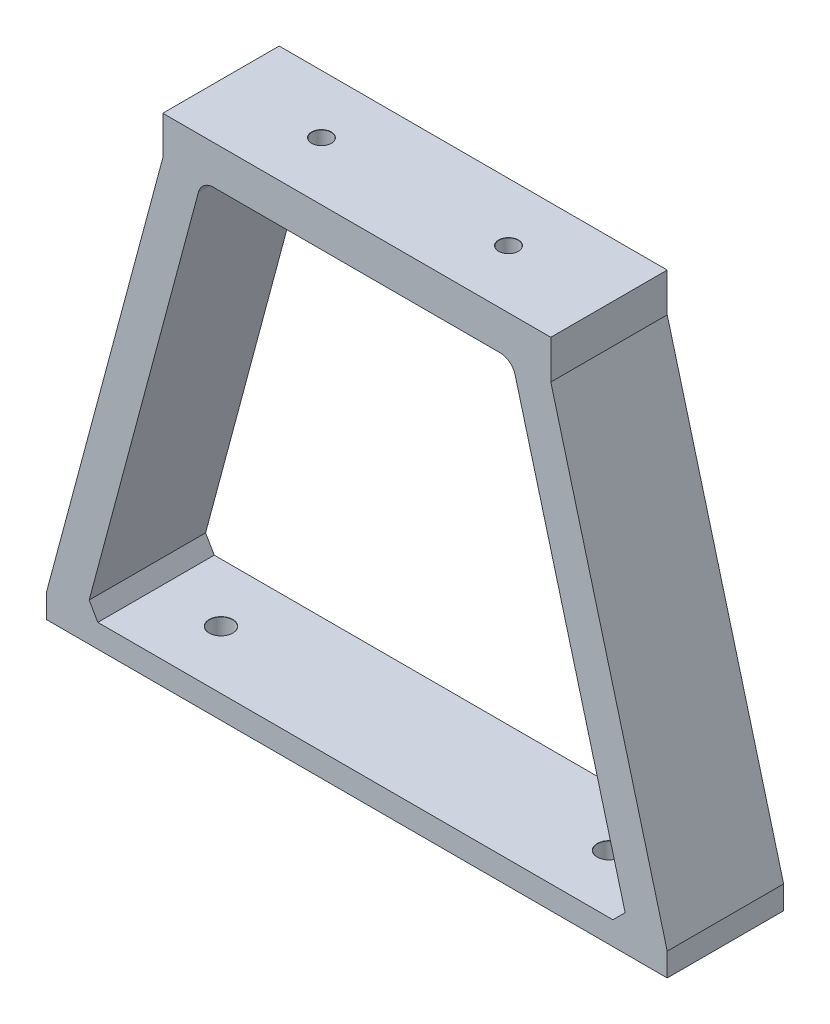
ISO-10303-21;
HEADER;
FILE_DESCRIPTION(('STEP AP214'),'2;1');
FILE_NAME('part.step','',(''),(''),'','','');
FILE_SCHEMA(('AUTOMOTIVE_DESIGN { 1 0 10303 214 1 1 1 1 }'));
ENDSEC;
DATA;
#1=APPLICATION_CONTEXT('core data for automotive mechanical design processes');
#2=APPLICATION_PROTOCOL_DEFINITION('international standard','automotive_design',2000,#1);
#3=PRODUCT_CONTEXT('',#1,'mechanical');
#4=PRODUCT('Part','Part','',(#3));
#5=PRODUCT_RELATED_PRODUCT_CATEGORY('part','',(#4));
#6=PRODUCT_DEFINITION_FORMATION('','',#4);
#7=PRODUCT_DEFINITION_CONTEXT('part definition',#1,'design');
#8=PRODUCT_DEFINITION('design','',#6,#7);
#9=PRODUCT_DEFINITION_SHAPE('','',#8);
#10=(LENGTH_UNIT() NAMED_UNIT(*) SI_UNIT(.MILLI.,.METRE.));
#11=(NAMED_UNIT(*) PLANE_ANGLE_UNIT() SI_UNIT($,.RADIAN.));
#12=(NAMED_UNIT(*) SI_UNIT($,.STERADIAN.) SOLID_ANGLE_UNIT());
#13=UNCERTAINTY_MEASURE_WITH_UNIT(LENGTH_MEASURE(1.E-05),#10,'distance_accuracy_value','');
#14=(GEOMETRIC_REPRESENTATION_CONTEXT(3) GLOBAL_UNCERTAINTY_ASSIGNED_CONTEXT((#13)) GLOBAL_UNIT_ASSIGNED_CONTEXT((#10,
#11,#12)) REPRESENTATION_CONTEXT('',''));
#15=CARTESIAN_POINT('',(0.,0.,0.));
#16=DIRECTION('',(0.,0.,1.));
#17=DIRECTION('',(1.,0.,0.));
#18=AXIS2_PLACEMENT_3D('',#15,#16,#17);
#19=CARTESIAN_POINT('',(25.,5.,-7.5));
#20=DIRECTION('',(-1.,0.,0.));
#21=DIRECTION('',(0.,0.,1.));
#22=AXIS2_PLACEMENT_3D('',#19,#20,#21);
#23=PLANE('',#22);
#24=DIRECTION('',(0.,0.,-1.));
#25=VECTOR('',#24,1.);
#26=CARTESIAN_POINT('',(25.,0.,-7.5));
#27=LINE('',#26,#25);
#28=CARTESIAN_POINT('',(25.,0.,7.5));
#29=VERTEX_POINT('',#28);
#30=CARTESIAN_POINT('',(25.,0.,-7.5));
#31=VERTEX_POINT('',#30);
#32=EDGE_CURVE('E228',#29,#31,#27,.T.);
#33=ORIENTED_EDGE('',*,*,#32,.T.);
#34=DIRECTION('',(0.,-1.,0.));
#35=VECTOR('',#34,1.);
#36=CARTESIAN_POINT('',(25.,5.,-7.5));
#37=LINE('',#36,#35);
#38=CARTESIAN_POINT('',(25.,5.,-7.5));
#39=VERTEX_POINT('',#38);
#40=EDGE_CURVE('E269',#39,#31,#37,.T.);
#41=ORIENTED_EDGE('',*,*,#40,.F.);
#42=DIRECTION('',(0.,0.,-1.));
#43=VECTOR('',#42,1.);
#44=CARTESIAN_POINT('',(25.,5.,-7.5));
#45=LINE('',#44,#43);
#46=CARTESIAN_POINT('',(25.,5.,7.5));
#47=VERTEX_POINT('',#46);
#48=EDGE_CURVE('E229',#47,#39,#45,.T.);
#49=ORIENTED_EDGE('',*,*,#48,.F.);
#50=DIRECTION('',(0.,-1.,0.));
#51=VECTOR('',#50,1.);
#52=CARTESIAN_POINT('',(25.,5.,7.5));
#53=LINE('',#52,#51);
#54=EDGE_CURVE('E243',#47,#29,#53,.T.);
#55=ORIENTED_EDGE('',*,*,#54,.T.);
#56=EDGE_LOOP('',(#33,#41,#49,#55));
#57=FACE_BOUND('',#56,.T.);
#58=ADVANCED_FACE('F45',(#57),#23,.F.);
#59=CARTESIAN_POINT('',(-25.,5.,-7.5));
#60=DIRECTION('',(0.,0.,1.));
#61=DIRECTION('',(1.,0.,0.));
#62=AXIS2_PLACEMENT_3D('',#59,#60,#61);
#63=PLANE('',#62);
#64=DIRECTION('',(-0.258736085224084,-0.965948051503245,0.));
#65=VECTOR('',#64,1.);
#66=CARTESIAN_POINT('',(-35.,-56.,-7.5));
#67=LINE('',#66,#65);
#68=CARTESIAN_POINT('',(-20.39710566863,-1.48252782955182,-7.5));
#69=VERTEX_POINT('',#68);
#70=CARTESIAN_POINT('',(-34.4825278295518,-54.0681038969935,-7.5));
#71=VERTEX_POINT('',#70);
#72=EDGE_CURVE('E194',#69,#71,#67,.T.);
#73=ORIENTED_EDGE('',*,*,#72,.T.);
#74=DIRECTION('',(0.500074377092276,-0.865982457891482,0.));
#75=VECTOR('',#74,1.);
#76=CARTESIAN_POINT('',(-57.6909659674085,-13.8778817558279,-7.5));
#77=LINE('',#76,#75);
#78=CARTESIAN_POINT('',(-33.3669258545762,-56.,-7.5));
#79=VERTEX_POINT('',#78);
#80=EDGE_CURVE('E11',#71,#79,#77,.T.);
#81=ORIENTED_EDGE('',*,*,#80,.T.);
#82=DIRECTION('',(1.,0.,0.));
#83=VECTOR('',#82,1.);
#84=CARTESIAN_POINT('',(-40.,-56.,-7.5));
#85=LINE('',#84,#83);
#86=CARTESIAN_POINT('',(33.0000000000001,-55.9999999999999,-7.5));
#87=VERTEX_POINT('',#86);
#88=EDGE_CURVE('E324',#79,#87,#85,.T.);
#89=ORIENTED_EDGE('',*,*,#88,.T.);
#90=DIRECTION('',(0.70710678118654,0.707106781186555,0.));
#91=VECTOR('',#90,1.);
#92=CARTESIAN_POINT('',(34.5000000000006,-54.4999999999993,-7.5));
#93=LINE('',#92,#91);
#94=CARTESIAN_POINT('',(34.5774647887324,-54.4225352112676,-7.5));
#95=VERTEX_POINT('',#94);
#96=EDGE_CURVE('E315',#87,#95,#93,.T.);
#97=ORIENTED_EDGE('',*,*,#96,.T.);
#98=DIRECTION('',(-0.258736085224083,0.965948051503245,0.));
#99=VECTOR('',#98,1.);
#100=CARTESIAN_POINT('',(35.,-56.,-7.5));
#101=LINE('',#100,#99);
#102=CARTESIAN_POINT('',(20.39710566863,-1.48252782955183,-7.5));
#103=VERTEX_POINT('',#102);
#104=EDGE_CURVE('E215',#95,#103,#101,.T.);
#105=ORIENTED_EDGE('',*,*,#104,.T.);
#106=CARTESIAN_POINT('',(18.4652095656235,-2.,-7.5));
#107=DIRECTION('',(0.,0.,1.));
#108=DIRECTION('',(1.,0.,0.));
#109=AXIS2_PLACEMENT_3D('',#106,#107,#108);
#110=CIRCLE('',#109,2.);
#111=CARTESIAN_POINT('',(18.4652095656235,0.,-7.5));
#112=VERTEX_POINT('',#111);
#113=EDGE_CURVE('E290',#103,#112,#110,.T.);
#114=ORIENTED_EDGE('',*,*,#113,.T.);
#115=DIRECTION('',(-1.,0.,0.));
#116=VECTOR('',#115,1.);
#117=CARTESIAN_POINT('',(-25.,0.,-7.5));
#118=LINE('',#117,#116);
#119=CARTESIAN_POINT('',(-18.4652095656235,0.,-7.5));
#120=VERTEX_POINT('',#119);
#121=EDGE_CURVE('E247',#112,#120,#118,.T.);
#122=ORIENTED_EDGE('',*,*,#121,.T.);
#123=CARTESIAN_POINT('',(-18.4652095656235,-2.,-7.5));
#124=DIRECTION('',(0.,0.,1.));
#125=DIRECTION('',(1.,0.,0.));
#126=AXIS2_PLACEMENT_3D('',#123,#124,#125);
#127=CIRCLE('',#126,2.);
#128=EDGE_CURVE('E296',#120,#69,#127,.T.);
#129=ORIENTED_EDGE('',*,*,#128,.T.);
#130=EDGE_LOOP('',(#73,#81,#89,#97,#105,#114,#122,#129));
#131=FACE_BOUND('',#130,.T.);
#132=ORIENTED_EDGE('',*,*,#40,.T.);
#133=DIRECTION('',(0.258736085224084,-0.965948051503245,0.));
#134=VECTOR('',#133,1.);
#135=CARTESIAN_POINT('',(25.,0.,-7.5));
#136=LINE('',#135,#134);
#137=CARTESIAN_POINT('',(40.,-55.9999999999999,-7.5));
#138=VERTEX_POINT('',#137);
#139=EDGE_CURVE('E212',#31,#138,#136,.T.);
#140=ORIENTED_EDGE('',*,*,#139,.T.);
#141=DIRECTION('',(0.,1.,0.));
#142=VECTOR('',#141,1.);
#143=CARTESIAN_POINT('',(40.,-58.9999999999999,-7.5));
#144=LINE('',#143,#142);
#145=CARTESIAN_POINT('',(40.,-58.9999999999999,-7.5));
#146=VERTEX_POINT('',#145);
#147=EDGE_CURVE('E169',#146,#138,#144,.T.);
#148=ORIENTED_EDGE('',*,*,#147,.F.);
#149=DIRECTION('',(1.,0.,0.));
#150=VECTOR('',#149,1.);
#151=CARTESIAN_POINT('',(-40.,-59.,-7.5));
#152=LINE('',#151,#150);
#153=CARTESIAN_POINT('',(-40.,-59.,-7.5));
#154=VERTEX_POINT('',#153);
#155=EDGE_CURVE('E160',#154,#146,#152,.T.);
#156=ORIENTED_EDGE('',*,*,#155,.F.);
#157=DIRECTION('',(0.,1.,0.));
#158=VECTOR('',#157,1.);
#159=CARTESIAN_POINT('',(-40.,-59.,-7.5));
#160=LINE('',#159,#158);
#161=CARTESIAN_POINT('',(-40.,-56.,-7.5));
#162=VERTEX_POINT('',#161);
#163=EDGE_CURVE('E166',#154,#162,#160,.T.);
#164=ORIENTED_EDGE('',*,*,#163,.T.);
#165=DIRECTION('',(0.258736085224084,0.965948051503245,0.));
#166=VECTOR('',#165,1.);
#167=CARTESIAN_POINT('',(-25.,0.,-7.5));
#168=LINE('',#167,#166);
#169=CARTESIAN_POINT('',(-25.,0.,-7.5));
#170=VERTEX_POINT('',#169);
#171=EDGE_CURVE('E190',#162,#170,#168,.T.);
#172=ORIENTED_EDGE('',*,*,#171,.T.);
#173=DIRECTION('',(0.,-1.,0.));
#174=VECTOR('',#173,1.);
#175=CARTESIAN_POINT('',(-25.,5.,-7.5));
#176=LINE('',#175,#174);
#177=CARTESIAN_POINT('',(-25.,5.,-7.5));
#178=VERTEX_POINT('',#177);
#179=EDGE_CURVE('E265',#178,#170,#176,.T.);
#180=ORIENTED_EDGE('',*,*,#179,.F.);
#181=DIRECTION('',(-1.,0.,0.));
#182=VECTOR('',#181,1.);
#183=CARTESIAN_POINT('',(-25.,5.,-7.5));
#184=LINE('',#183,#182);
#185=EDGE_CURVE('E233',#39,#178,#184,.T.);
#186=ORIENTED_EDGE('',*,*,#185,.F.);
#187=EDGE_LOOP('',(#132,#140,#148,#156,#164,#172,#180,#186));
#188=FACE_BOUND('',#187,.T.);
#189=ADVANCED_FACE('F163',(#131,#188),#63,.F.);
#190=CARTESIAN_POINT('',(-25.,5.,-7.5));
#191=DIRECTION('',(1.,0.,0.));
#192=DIRECTION('',(0.,0.,-1.));
#193=AXIS2_PLACEMENT_3D('',#190,#191,#192);
#194=PLANE('',#193);
#195=DIRECTION('',(0.,0.,1.));
#196=VECTOR('',#195,1.);
#197=CARTESIAN_POINT('',(-25.,0.,-7.5));
#198=LINE('',#197,#196);
#199=CARTESIAN_POINT('',(-25.,0.,7.5));
#200=VERTEX_POINT('',#199);
#201=EDGE_CURVE('E251',#170,#200,#198,.T.);
#202=ORIENTED_EDGE('',*,*,#201,.T.);
#203=DIRECTION('',(0.,-1.,0.));
#204=VECTOR('',#203,1.);
#205=CARTESIAN_POINT('',(-25.,5.,7.5));
#206=LINE('',#205,#204);
#207=CARTESIAN_POINT('',(-25.,5.,7.5));
#208=VERTEX_POINT('',#207);
#209=EDGE_CURVE('E261',#208,#200,#206,.T.);
#210=ORIENTED_EDGE('',*,*,#209,.F.);
#211=DIRECTION('',(0.,0.,1.));
#212=VECTOR('',#211,1.);
#213=CARTESIAN_POINT('',(-25.,5.,-7.5));
#214=LINE('',#213,#212);
#215=EDGE_CURVE('E237',#178,#208,#214,.T.);
#216=ORIENTED_EDGE('',*,*,#215,.F.);
#217=ORIENTED_EDGE('',*,*,#179,.T.);
#218=EDGE_LOOP('',(#202,#210,#216,#217));
#219=FACE_BOUND('',#218,.T.);
#220=ADVANCED_FACE('F393',(#219),#194,.F.);
#221=CARTESIAN_POINT('',(-25.,5.,7.5));
#222=DIRECTION('',(0.,0.,-1.));
#223=DIRECTION('',(-1.,0.,0.));
#224=AXIS2_PLACEMENT_3D('',#221,#222,#223);
#225=PLANE('',#224);
#226=DIRECTION('',(0.,1.,0.));
#227=VECTOR('',#226,1.);
#228=CARTESIAN_POINT('',(40.,-58.9999999999999,7.5));
#229=LINE('',#228,#227);
#230=CARTESIAN_POINT('',(40.,-58.9999999999999,7.5));
#231=VERTEX_POINT('',#230);
#232=CARTESIAN_POINT('',(40.,-55.9999999999999,7.5));
#233=VERTEX_POINT('',#232);
#234=EDGE_CURVE('E196',#231,#233,#229,.T.);
#235=ORIENTED_EDGE('',*,*,#234,.T.);
#236=DIRECTION('',(-0.258736085224084,0.965948051503245,0.));
#237=VECTOR('',#236,1.);
#238=CARTESIAN_POINT('',(25.,0.,7.5));
#239=LINE('',#238,#237);
#240=EDGE_CURVE('E220',#233,#29,#239,.T.);
#241=ORIENTED_EDGE('',*,*,#240,.T.);
#242=ORIENTED_EDGE('',*,*,#54,.F.);
#243=DIRECTION('',(1.,0.,0.));
#244=VECTOR('',#243,1.);
#245=CARTESIAN_POINT('',(-25.,5.,7.5));
#246=LINE('',#245,#244);
#247=EDGE_CURVE('E240',#208,#47,#246,.T.);
#248=ORIENTED_EDGE('',*,*,#247,.F.);
#249=ORIENTED_EDGE('',*,*,#209,.T.);
#250=DIRECTION('',(-0.258736085224084,-0.965948051503245,0.));
#251=VECTOR('',#250,1.);
#252=CARTESIAN_POINT('',(-25.,0.,7.5));
#253=LINE('',#252,#251);
#254=CARTESIAN_POINT('',(-40.,-56.,7.5));
#255=VERTEX_POINT('',#254);
#256=EDGE_CURVE('E205',#200,#255,#253,.T.);
#257=ORIENTED_EDGE('',*,*,#256,.T.);
#258=DIRECTION('',(0.,1.,0.));
#259=VECTOR('',#258,1.);
#260=CARTESIAN_POINT('',(-40.,-59.,7.5));
#261=LINE('',#260,#259);
#262=CARTESIAN_POINT('',(-40.,-59.,7.5));
#263=VERTEX_POINT('',#262);
#264=EDGE_CURVE('E365',#263,#255,#261,.T.);
#265=ORIENTED_EDGE('',*,*,#264,.F.);
#266=DIRECTION('',(-1.,0.,0.));
#267=VECTOR('',#266,1.);
#268=CARTESIAN_POINT('',(-40.,-59.,7.5));
#269=LINE('',#268,#267);
#270=EDGE_CURVE('E179',#231,#263,#269,.T.);
#271=ORIENTED_EDGE('',*,*,#270,.F.);
#272=EDGE_LOOP('',(#235,#241,#242,#248,#249,#257,#265,#271));
#273=FACE_BOUND('',#272,.T.);
#274=DIRECTION('',(0.258736085224083,-0.965948051503245,0.));
#275=VECTOR('',#274,1.);
#276=CARTESIAN_POINT('',(35.,-56.,7.5));
#277=LINE('',#276,#275);
#278=CARTESIAN_POINT('',(20.39710566863,-1.48252782955184,7.5));
#279=VERTEX_POINT('',#278);
#280=CARTESIAN_POINT('',(34.5774647887324,-54.4225352112676,7.5));
#281=VERTEX_POINT('',#280);
#282=EDGE_CURVE('E209',#279,#281,#277,.T.);
#283=ORIENTED_EDGE('',*,*,#282,.T.);
#284=DIRECTION('',(-0.70710678118654,-0.707106781186555,0.));
#285=VECTOR('',#284,1.);
#286=CARTESIAN_POINT('',(34.5000000000006,-54.4999999999993,7.5));
#287=LINE('',#286,#285);
#288=CARTESIAN_POINT('',(33.0000000000001,-55.9999999999999,7.5));
#289=VERTEX_POINT('',#288);
#290=EDGE_CURVE('E312',#281,#289,#287,.T.);
#291=ORIENTED_EDGE('',*,*,#290,.T.);
#292=DIRECTION('',(-1.,0.,0.));
#293=VECTOR('',#292,1.);
#294=CARTESIAN_POINT('',(-40.,-56.,7.5));
#295=LINE('',#294,#293);
#296=CARTESIAN_POINT('',(-33.3669258545762,-56.,7.5));
#297=VERTEX_POINT('',#296);
#298=EDGE_CURVE('E183',#289,#297,#295,.T.);
#299=ORIENTED_EDGE('',*,*,#298,.T.);
#300=DIRECTION('',(-0.500074377092276,0.865982457891482,0.));
#301=VECTOR('',#300,1.);
#302=CARTESIAN_POINT('',(-57.6909659674085,-13.8778817558279,7.5));
#303=LINE('',#302,#301);
#304=CARTESIAN_POINT('',(-34.4825278295518,-54.0681038969935,7.5));
#305=VERTEX_POINT('',#304);
#306=EDGE_CURVE('E56',#297,#305,#303,.T.);
#307=ORIENTED_EDGE('',*,*,#306,.T.);
#308=DIRECTION('',(0.258736085224084,0.965948051503245,0.));
#309=VECTOR('',#308,1.);
#310=CARTESIAN_POINT('',(-35.,-56.,7.5));
#311=LINE('',#310,#309);
#312=CARTESIAN_POINT('',(-20.39710566863,-1.48252782955183,7.5));
#313=VERTEX_POINT('',#312);
#314=EDGE_CURVE('E202',#305,#313,#311,.T.);
#315=ORIENTED_EDGE('',*,*,#314,.T.);
#316=CARTESIAN_POINT('',(-18.4652095656235,-2.,7.49999999999999));
#317=DIRECTION('',(0.,0.,-1.));
#318=DIRECTION('',(-1.,0.,0.));
#319=AXIS2_PLACEMENT_3D('',#316,#317,#318);
#320=CIRCLE('',#319,2.);
#321=CARTESIAN_POINT('',(-18.4652095656235,0.,7.5));
#322=VERTEX_POINT('',#321);
#323=EDGE_CURVE('E293',#313,#322,#320,.T.);
#324=ORIENTED_EDGE('',*,*,#323,.T.);
#325=DIRECTION('',(1.,0.,0.));
#326=VECTOR('',#325,1.);
#327=CARTESIAN_POINT('',(-25.,0.,7.5));
#328=LINE('',#327,#326);
#329=CARTESIAN_POINT('',(18.4652095656235,0.,7.5));
#330=VERTEX_POINT('',#329);
#331=EDGE_CURVE('E234',#322,#330,#328,.T.);
#332=ORIENTED_EDGE('',*,*,#331,.T.);
#333=CARTESIAN_POINT('',(18.4652095656235,-2.,7.5));
#334=DIRECTION('',(0.,0.,-1.));
#335=DIRECTION('',(-1.,0.,0.));
#336=AXIS2_PLACEMENT_3D('',#333,#334,#335);
#337=CIRCLE('',#336,2.);
#338=EDGE_CURVE('E287',#330,#279,#337,.T.);
#339=ORIENTED_EDGE('',*,*,#338,.T.);
#340=EDGE_LOOP('',(#283,#291,#299,#307,#315,#324,#332,#339));
#341=FACE_BOUND('',#340,.T.);
#342=ADVANCED_FACE('F377',(#273,#341),#225,.F.);
#343=CARTESIAN_POINT('',(0.,5.,0.));
#344=DIRECTION('',(0.,1.,0.));
#345=DIRECTION('',(0.,0.,1.));
#346=AXIS2_PLACEMENT_3D('',#343,#344,#345);
#347=PLANE('',#346);
#348=CARTESIAN_POINT('',(-12.0500000000001,5.,0.));
#349=DIRECTION('',(0.,1.,0.));
#350=DIRECTION('',(0.,0.,1.));
#351=AXIS2_PLACEMENT_3D('',#348,#349,#350);
#352=CIRCLE('',#351,1.275);
#353=CARTESIAN_POINT('',(-12.0500000000001,5.,1.27500000000004));
#354=VERTEX_POINT('',#353);
#355=EDGE_CURVE('E734',#354,#354,#352,.T.);
#356=ORIENTED_EDGE('',*,*,#355,.F.);
#357=EDGE_LOOP('',(#356));
#358=FACE_BOUND('',#357,.T.);
#359=CARTESIAN_POINT('',(12.0499999999999,5.,0.));
#360=DIRECTION('',(0.,1.,0.));
#361=DIRECTION('',(0.,0.,1.));
#362=AXIS2_PLACEMENT_3D('',#359,#360,#361);
#363=CIRCLE('',#362,1.275);
#364=CARTESIAN_POINT('',(12.0499999999999,5.,1.27500000000004));
#365=VERTEX_POINT('',#364);
#366=EDGE_CURVE('E343',#365,#365,#363,.T.);
#367=ORIENTED_EDGE('',*,*,#366,.F.);
#368=EDGE_LOOP('',(#367));
#369=FACE_BOUND('',#368,.T.);
#370=ORIENTED_EDGE('',*,*,#48,.T.);
#371=ORIENTED_EDGE('',*,*,#185,.T.);
#372=ORIENTED_EDGE('',*,*,#215,.T.);
#373=ORIENTED_EDGE('',*,*,#247,.T.);
#374=EDGE_LOOP('',(#370,#371,#372,#373));
#375=FACE_BOUND('',#374,.T.);
#376=ADVANCED_FACE('F389',(#358,#369,#375),#347,.T.);
#377=CARTESIAN_POINT('',(0.,0.,0.));
#378=DIRECTION('',(0.,1.,0.));
#379=DIRECTION('',(0.,0.,1.));
#380=AXIS2_PLACEMENT_3D('',#377,#378,#379);
#381=PLANE('',#380);
#382=CARTESIAN_POINT('',(-12.0500000000001,0.,0.));
#383=DIRECTION('',(0.,1.,0.));
#384=DIRECTION('',(0.,0.,1.));
#385=AXIS2_PLACEMENT_3D('',#382,#383,#384);
#386=CIRCLE('',#385,1.25);
#387=CARTESIAN_POINT('',(-12.0500000000001,0.,1.25000000000003));
#388=VERTEX_POINT('',#387);
#389=EDGE_CURVE('E50',#388,#388,#386,.T.);
#390=ORIENTED_EDGE('',*,*,#389,.T.);
#391=EDGE_LOOP('',(#390));
#392=FACE_BOUND('',#391,.T.);
#393=CARTESIAN_POINT('',(12.0499999999999,0.,0.));
#394=DIRECTION('',(0.,1.,0.));
#395=DIRECTION('',(0.,0.,1.));
#396=AXIS2_PLACEMENT_3D('',#393,#394,#395);
#397=CIRCLE('',#396,1.25);
#398=CARTESIAN_POINT('',(12.0499999999999,0.,1.25000000000003));
#399=VERTEX_POINT('',#398);
#400=EDGE_CURVE('E331',#399,#399,#397,.T.);
#401=ORIENTED_EDGE('',*,*,#400,.T.);
#402=EDGE_LOOP('',(#401));
#403=FACE_BOUND('',#402,.T.);
#404=ORIENTED_EDGE('',*,*,#121,.F.);
#405=DIRECTION('',(0.,0.,1.));
#406=VECTOR('',#405,1.);
#407=CARTESIAN_POINT('',(18.4652095656235,0.,0.));
#408=LINE('',#407,#406);
#409=EDGE_CURVE('E275',#112,#330,#408,.T.);
#410=ORIENTED_EDGE('',*,*,#409,.T.);
#411=ORIENTED_EDGE('',*,*,#331,.F.);
#412=DIRECTION('',(0.,0.,1.));
#413=VECTOR('',#412,1.);
#414=CARTESIAN_POINT('',(-18.4652095656235,0.,0.));
#415=LINE('',#414,#413);
#416=EDGE_CURVE('E272',#322,#120,#415,.F.);
#417=ORIENTED_EDGE('',*,*,#416,.T.);
#418=EDGE_LOOP('',(#404,#410,#411,#417));
#419=FACE_BOUND('',#418,.T.);
#420=ADVANCED_FACE('F449',(#392,#403,#419),#381,.F.);
#421=CARTESIAN_POINT('',(25.,0.,-66.964274989274));
#422=DIRECTION('',(0.965948051503245,0.258736085224084,0.));
#423=DIRECTION('',(-0.258736085224084,0.965948051503245,0.));
#424=AXIS2_PLACEMENT_3D('',#421,#422,#423);
#425=PLANE('',#424);
#426=ORIENTED_EDGE('',*,*,#139,.F.);
#427=ORIENTED_EDGE('',*,*,#32,.F.);
#428=ORIENTED_EDGE('',*,*,#240,.F.);
#429=DIRECTION('',(0.,0.,1.));
#430=VECTOR('',#429,1.);
#431=CARTESIAN_POINT('',(40.,-56.,-66.964274989274));
#432=LINE('',#431,#430);
#433=EDGE_CURVE('E216',#138,#233,#432,.T.);
#434=ORIENTED_EDGE('',*,*,#433,.F.);
#435=EDGE_LOOP('',(#426,#427,#428,#434));
#436=FACE_BOUND('',#435,.T.);
#437=ADVANCED_FACE('F382',(#436),#425,.T.);
#438=CARTESIAN_POINT('',(35.,-56.,-66.964274989274));
#439=DIRECTION('',(-0.965948051503245,-0.258736085224083,0.));
#440=DIRECTION('',(0.258736085224083,-0.965948051503245,0.));
#441=AXIS2_PLACEMENT_3D('',#438,#439,#440);
#442=PLANE('',#441);
#443=ORIENTED_EDGE('',*,*,#104,.F.);
#444=DIRECTION('',(0.,0.,1.));
#445=VECTOR('',#444,1.);
#446=CARTESIAN_POINT('',(34.5774647887324,-54.4225352112676,-66.964274989274));
#447=LINE('',#446,#445);
#448=EDGE_CURVE('E299',#95,#281,#447,.T.);
#449=ORIENTED_EDGE('',*,*,#448,.T.);
#450=ORIENTED_EDGE('',*,*,#282,.F.);
#451=DIRECTION('',(0.,0.,1.));
#452=VECTOR('',#451,1.);
#453=CARTESIAN_POINT('',(20.39710566863,-1.48252782955183,-66.964274989274));
#454=LINE('',#453,#452);
#455=EDGE_CURVE('E279',#279,#103,#454,.F.);
#456=ORIENTED_EDGE('',*,*,#455,.T.);
#457=EDGE_LOOP('',(#443,#449,#450,#456));
#458=FACE_BOUND('',#457,.T.);
#459=ADVANCED_FACE('F407',(#458),#442,.T.);
#460=CARTESIAN_POINT('',(-35.,-56.,-66.964274989274));
#461=DIRECTION('',(0.965948051503245,-0.258736085224084,0.));
#462=DIRECTION('',(0.258736085224084,0.965948051503245,0.));
#463=AXIS2_PLACEMENT_3D('',#460,#461,#462);
#464=PLANE('',#463);
#465=ORIENTED_EDGE('',*,*,#314,.F.);
#466=DIRECTION('',(0.,0.,-1.));
#467=VECTOR('',#466,1.);
#468=CARTESIAN_POINT('',(-34.4825278295518,-54.0681038969935,-66.964274989274));
#469=LINE('',#468,#467);
#470=EDGE_CURVE('E70',#305,#71,#469,.T.);
#471=ORIENTED_EDGE('',*,*,#470,.T.);
#472=ORIENTED_EDGE('',*,*,#72,.F.);
#473=DIRECTION('',(0.,0.,1.));
#474=VECTOR('',#473,1.);
#475=CARTESIAN_POINT('',(-20.39710566863,-1.48252782955183,-66.964274989274));
#476=LINE('',#475,#474);
#477=EDGE_CURVE('E283',#69,#313,#476,.T.);
#478=ORIENTED_EDGE('',*,*,#477,.T.);
#479=EDGE_LOOP('',(#465,#471,#472,#478));
#480=FACE_BOUND('',#479,.T.);
#481=ADVANCED_FACE('F398',(#480),#464,.T.);
#482=CARTESIAN_POINT('',(-25.,0.,-66.964274989274));
#483=DIRECTION('',(-0.965948051503245,0.258736085224084,0.));
#484=DIRECTION('',(-0.258736085224084,-0.965948051503245,0.));
#485=AXIS2_PLACEMENT_3D('',#482,#483,#484);
#486=PLANE('',#485);
#487=ORIENTED_EDGE('',*,*,#171,.F.);
#488=DIRECTION('',(0.,0.,1.));
#489=VECTOR('',#488,1.);
#490=CARTESIAN_POINT('',(-40.,-56.,-66.964274989274));
#491=LINE('',#490,#489);
#492=EDGE_CURVE('E187',#162,#255,#491,.T.);
#493=ORIENTED_EDGE('',*,*,#492,.T.);
#494=ORIENTED_EDGE('',*,*,#256,.F.);
#495=ORIENTED_EDGE('',*,*,#201,.F.);
#496=EDGE_LOOP('',(#487,#493,#494,#495));
#497=FACE_BOUND('',#496,.T.);
#498=ADVANCED_FACE('F395',(#497),#486,.T.);
#499=CARTESIAN_POINT('',(18.4652095656235,-2.,0.));
#500=DIRECTION('',(0.,0.,1.));
#501=DIRECTION('',(1.,0.,0.));
#502=AXIS2_PLACEMENT_3D('',#499,#500,#501);
#503=CYLINDRICAL_SURFACE('',#502,2.);
#504=ORIENTED_EDGE('',*,*,#113,.F.);
#505=ORIENTED_EDGE('',*,*,#455,.F.);
#506=ORIENTED_EDGE('',*,*,#338,.F.);
#507=ORIENTED_EDGE('',*,*,#409,.F.);
#508=EDGE_LOOP('',(#504,#505,#506,#507));
#509=FACE_BOUND('',#508,.T.);
#510=ADVANCED_FACE('F397',(#509),#503,.F.);
#511=CARTESIAN_POINT('',(-18.4652095656235,-2.,-66.964274989274));
#512=DIRECTION('',(0.,0.,1.));
#513=DIRECTION('',(1.,0.,0.));
#514=AXIS2_PLACEMENT_3D('',#511,#512,#513);
#515=CYLINDRICAL_SURFACE('',#514,2.);
#516=ORIENTED_EDGE('',*,*,#128,.F.);
#517=ORIENTED_EDGE('',*,*,#416,.F.);
#518=ORIENTED_EDGE('',*,*,#323,.F.);
#519=ORIENTED_EDGE('',*,*,#477,.F.);
#520=EDGE_LOOP('',(#516,#517,#518,#519));
#521=FACE_BOUND('',#520,.T.);
#522=ADVANCED_FACE('F404',(#521),#515,.F.);
#523=CARTESIAN_POINT('',(-40.,-59.,7.5));
#524=DIRECTION('',(1.,0.,0.));
#525=DIRECTION('',(0.,1.,0.));
#526=AXIS2_PLACEMENT_3D('',#523,#524,#525);
#527=PLANE('',#526);
#528=ORIENTED_EDGE('',*,*,#492,.F.);
#529=ORIENTED_EDGE('',*,*,#163,.F.);
#530=DIRECTION('',(0.,0.,-1.));
#531=VECTOR('',#530,1.);
#532=CARTESIAN_POINT('',(-40.,-59.,7.5));
#533=LINE('',#532,#531);
#534=EDGE_CURVE('E174',#263,#154,#533,.T.);
#535=ORIENTED_EDGE('',*,*,#534,.F.);
#536=ORIENTED_EDGE('',*,*,#264,.T.);
#537=EDGE_LOOP('',(#528,#529,#535,#536));
#538=FACE_BOUND('',#537,.T.);
#539=ADVANCED_FACE('F185',(#538),#527,.F.);
#540=CARTESIAN_POINT('',(40.,-58.9999999999999,7.5));
#541=DIRECTION('',(-1.,0.,0.));
#542=DIRECTION('',(0.,-1.,0.));
#543=AXIS2_PLACEMENT_3D('',#540,#541,#542);
#544=PLANE('',#543);
#545=ORIENTED_EDGE('',*,*,#433,.T.);
#546=ORIENTED_EDGE('',*,*,#234,.F.);
#547=DIRECTION('',(0.,0.,1.));
#548=VECTOR('',#547,1.);
#549=CARTESIAN_POINT('',(40.,-58.9999999999999,7.5));
#550=LINE('',#549,#548);
#551=EDGE_CURVE('E173',#146,#231,#550,.T.);
#552=ORIENTED_EDGE('',*,*,#551,.F.);
#553=ORIENTED_EDGE('',*,*,#147,.T.);
#554=EDGE_LOOP('',(#545,#546,#552,#553));
#555=FACE_BOUND('',#554,.T.);
#556=ADVANCED_FACE('F512',(#555),#544,.F.);
#557=CARTESIAN_POINT('',(0.,-58.9999999999999,0.));
#558=DIRECTION('',(0.,-1.,0.));
#559=DIRECTION('',(1.,0.,0.));
#560=AXIS2_PLACEMENT_3D('',#557,#558,#559);
#561=PLANE('',#560);
#562=CARTESIAN_POINT('',(-24.9999999999999,-59.,0.));
#563=DIRECTION('',(0.,-1.,0.));
#564=DIRECTION('',(1.,0.,0.));
#565=AXIS2_PLACEMENT_3D('',#562,#563,#564);
#566=CIRCLE('',#565,1.5);
#567=CARTESIAN_POINT('',(-23.4999999999999,-59.,0.));
#568=VERTEX_POINT('',#567);
#569=EDGE_CURVE('E326',#568,#568,#566,.T.);
#570=ORIENTED_EDGE('',*,*,#569,.F.);
#571=EDGE_LOOP('',(#570));
#572=FACE_BOUND('',#571,.T.);
#573=CARTESIAN_POINT('',(25.0000000000001,-58.9999999999999,0.));
#574=DIRECTION('',(0.,-1.,0.));
#575=DIRECTION('',(1.,0.,0.));
#576=AXIS2_PLACEMENT_3D('',#573,#574,#575);
#577=CIRCLE('',#576,1.5);
#578=CARTESIAN_POINT('',(26.5000000000001,-58.9999999999999,0.));
#579=VERTEX_POINT('',#578);
#580=EDGE_CURVE('E320',#579,#579,#577,.T.);
#581=ORIENTED_EDGE('',*,*,#580,.F.);
#582=EDGE_LOOP('',(#581));
#583=FACE_BOUND('',#582,.T.);
#584=ORIENTED_EDGE('',*,*,#534,.T.);
#585=ORIENTED_EDGE('',*,*,#155,.T.);
#586=ORIENTED_EDGE('',*,*,#551,.T.);
#587=ORIENTED_EDGE('',*,*,#270,.T.);
#588=EDGE_LOOP('',(#584,#585,#586,#587));
#589=FACE_BOUND('',#588,.T.);
#590=ADVANCED_FACE('F177',(#572,#583,#589),#561,.T.);
#591=CARTESIAN_POINT('',(0.,-55.9999999999999,0.));
#592=DIRECTION('',(0.,-1.,0.));
#593=DIRECTION('',(1.,0.,0.));
#594=AXIS2_PLACEMENT_3D('',#591,#592,#593);
#595=PLANE('',#594);
#596=CARTESIAN_POINT('',(-24.9999999999999,-56.,0.));
#597=DIRECTION('',(0.,1.,0.));
#598=DIRECTION('',(0.,0.,1.));
#599=AXIS2_PLACEMENT_3D('',#596,#597,#598);
#600=CIRCLE('',#599,1.525);
#601=CARTESIAN_POINT('',(-24.9999999999999,-56.,1.525));
#602=VERTEX_POINT('',#601);
#603=EDGE_CURVE('E334',#602,#602,#600,.T.);
#604=ORIENTED_EDGE('',*,*,#603,.F.);
#605=EDGE_LOOP('',(#604));
#606=FACE_BOUND('',#605,.T.);
#607=CARTESIAN_POINT('',(25.0000000000001,-55.9999999999999,0.));
#608=DIRECTION('',(0.,1.,0.));
#609=DIRECTION('',(0.,0.,1.));
#610=AXIS2_PLACEMENT_3D('',#607,#608,#609);
#611=CIRCLE('',#610,1.525);
#612=CARTESIAN_POINT('',(25.0000000000001,-55.9999999999999,1.52499999999999));
#613=VERTEX_POINT('',#612);
#614=EDGE_CURVE('E329',#613,#613,#611,.T.);
#615=ORIENTED_EDGE('',*,*,#614,.F.);
#616=EDGE_LOOP('',(#615));
#617=FACE_BOUND('',#616,.T.);
#618=ORIENTED_EDGE('',*,*,#298,.F.);
#619=DIRECTION('',(0.,0.,-1.));
#620=VECTOR('',#619,1.);
#621=CARTESIAN_POINT('',(33.0000000000001,-55.9999999999999,0.));
#622=LINE('',#621,#620);
#623=EDGE_CURVE('E307',#289,#87,#622,.T.);
#624=ORIENTED_EDGE('',*,*,#623,.T.);
#625=ORIENTED_EDGE('',*,*,#88,.F.);
#626=DIRECTION('',(0.,0.,1.));
#627=VECTOR('',#626,1.);
#628=CARTESIAN_POINT('',(-33.3669258545762,-56.,0.));
#629=LINE('',#628,#627);
#630=EDGE_CURVE('E303',#79,#297,#629,.T.);
#631=ORIENTED_EDGE('',*,*,#630,.T.);
#632=EDGE_LOOP('',(#618,#624,#625,#631));
#633=FACE_BOUND('',#632,.T.);
#634=ADVANCED_FACE('F426',(#606,#617,#633),#595,.F.);
#635=CARTESIAN_POINT('',(34.5774647887324,-54.4225352112676,-66.964274989274));
#636=DIRECTION('',(0.707106781186555,-0.70710678118654,0.));
#637=DIRECTION('',(0.,0.,1.));
#638=AXIS2_PLACEMENT_3D('',#635,#636,#637);
#639=PLANE('',#638);
#640=ORIENTED_EDGE('',*,*,#96,.F.);
#641=ORIENTED_EDGE('',*,*,#623,.F.);
#642=ORIENTED_EDGE('',*,*,#290,.F.);
#643=ORIENTED_EDGE('',*,*,#448,.F.);
#644=EDGE_LOOP('',(#640,#641,#642,#643));
#645=FACE_BOUND('',#644,.T.);
#646=ADVANCED_FACE('F422',(#645),#639,.F.);
#647=CARTESIAN_POINT('',(-33.3669258545762,-56.,0.));
#648=DIRECTION('',(-0.865982457891482,-0.500074377092276,0.));
#649=DIRECTION('',(0.,0.,1.));
#650=AXIS2_PLACEMENT_3D('',#647,#648,#649);
#651=PLANE('',#650);
#652=ORIENTED_EDGE('',*,*,#80,.F.);
#653=ORIENTED_EDGE('',*,*,#470,.F.);
#654=ORIENTED_EDGE('',*,*,#306,.F.);
#655=ORIENTED_EDGE('',*,*,#630,.F.);
#656=EDGE_LOOP('',(#652,#653,#654,#655));
#657=FACE_BOUND('',#656,.T.);
#658=ADVANCED_FACE('F48',(#657),#651,.F.);
#659=CARTESIAN_POINT('',(25.0000000000001,-55.9999999999999,0.));
#660=DIRECTION('',(0.,1.,0.));
#661=DIRECTION('',(0.,0.,1.));
#662=AXIS2_PLACEMENT_3D('',#659,#660,#661);
#663=CYLINDRICAL_SURFACE('',#662,1.5);
#664=ORIENTED_EDGE('',*,*,#580,.T.);
#665=EDGE_LOOP('',(#664));
#666=FACE_BOUND('',#665,.T.);
#667=CARTESIAN_POINT('',(25.0000000000001,-56.0249999999999,0.));
#668=DIRECTION('',(0.,1.,0.));
#669=DIRECTION('',(0.,0.,1.));
#670=AXIS2_PLACEMENT_3D('',#667,#668,#669);
#671=CIRCLE('',#670,1.5);
#672=CARTESIAN_POINT('',(25.0000000000001,-56.0249999999999,1.49999999999999));
#673=VERTEX_POINT('',#672);
#674=EDGE_CURVE('E325',#673,#673,#671,.T.);
#675=ORIENTED_EDGE('',*,*,#674,.T.);
#676=EDGE_LOOP('',(#675));
#677=FACE_BOUND('',#676,.T.);
#678=ADVANCED_FACE('F432',(#666,#677),#663,.F.);
#679=CARTESIAN_POINT('',(25.0000000000001,-55.9999999999999,0.));
#680=DIRECTION('',(0.,1.,0.));
#681=DIRECTION('',(0.,0.,1.));
#682=AXIS2_PLACEMENT_3D('',#679,#680,#681);
#683=CONICAL_SURFACE('',#682,1.525,0.785398163397518);
#684=ORIENTED_EDGE('',*,*,#674,.F.);
#685=EDGE_LOOP('',(#684));
#686=FACE_BOUND('',#685,.T.);
#687=ORIENTED_EDGE('',*,*,#614,.T.);
#688=EDGE_LOOP('',(#687));
#689=FACE_BOUND('',#688,.T.);
#690=ADVANCED_FACE('F529',(#686,#689),#683,.F.);
#691=CARTESIAN_POINT('',(-24.9999999999999,-56.,0.));
#692=DIRECTION('',(0.,1.,0.));
#693=DIRECTION('',(0.,0.,1.));
#694=AXIS2_PLACEMENT_3D('',#691,#692,#693);
#695=CYLINDRICAL_SURFACE('',#694,1.5);
#696=ORIENTED_EDGE('',*,*,#569,.T.);
#697=EDGE_LOOP('',(#696));
#698=FACE_BOUND('',#697,.T.);
#699=CARTESIAN_POINT('',(-24.9999999999999,-56.025,0.));
#700=DIRECTION('',(0.,1.,0.));
#701=DIRECTION('',(0.,0.,1.));
#702=AXIS2_PLACEMENT_3D('',#699,#700,#701);
#703=CIRCLE('',#702,1.5);
#704=CARTESIAN_POINT('',(-24.9999999999999,-56.025,1.5));
#705=VERTEX_POINT('',#704);
#706=EDGE_CURVE('E330',#705,#705,#703,.T.);
#707=ORIENTED_EDGE('',*,*,#706,.T.);
#708=EDGE_LOOP('',(#707));
#709=FACE_BOUND('',#708,.T.);
#710=ADVANCED_FACE('F540',(#698,#709),#695,.F.);
#711=CARTESIAN_POINT('',(-24.9999999999999,-56.,0.));
#712=DIRECTION('',(0.,1.,0.));
#713=DIRECTION('',(0.,0.,1.));
#714=AXIS2_PLACEMENT_3D('',#711,#712,#713);
#715=CONICAL_SURFACE('',#714,1.525,0.785398163397518);
#716=ORIENTED_EDGE('',*,*,#706,.F.);
#717=EDGE_LOOP('',(#716));
#718=FACE_BOUND('',#717,.T.);
#719=ORIENTED_EDGE('',*,*,#603,.T.);
#720=EDGE_LOOP('',(#719));
#721=FACE_BOUND('',#720,.T.);
#722=ADVANCED_FACE('F551',(#718,#721),#715,.F.);
#723=CARTESIAN_POINT('',(12.0499999999999,5.,0.));
#724=DIRECTION('',(0.,1.,0.));
#725=DIRECTION('',(0.,0.,1.));
#726=AXIS2_PLACEMENT_3D('',#723,#724,#725);
#727=CYLINDRICAL_SURFACE('',#726,1.25);
#728=CARTESIAN_POINT('',(12.0499999999999,4.975,0.));
#729=DIRECTION('',(0.,1.,0.));
#730=DIRECTION('',(0.,0.,1.));
#731=AXIS2_PLACEMENT_3D('',#728,#729,#730);
#732=CIRCLE('',#731,1.25);
#733=CARTESIAN_POINT('',(12.0499999999999,4.975,1.25000000000003));
#734=VERTEX_POINT('',#733);
#735=EDGE_CURVE('E335',#734,#734,#732,.T.);
#736=ORIENTED_EDGE('',*,*,#735,.T.);
#737=EDGE_LOOP('',(#736));
#738=FACE_BOUND('',#737,.T.);
#739=ORIENTED_EDGE('',*,*,#400,.F.);
#740=EDGE_LOOP('',(#739));
#741=FACE_BOUND('',#740,.T.);
#742=ADVANCED_FACE('F562',(#738,#741),#727,.F.);
#743=CARTESIAN_POINT('',(12.0499999999999,5.,0.));
#744=DIRECTION('',(0.,1.,0.));
#745=DIRECTION('',(0.,0.,1.));
#746=AXIS2_PLACEMENT_3D('',#743,#744,#745);
#747=CONICAL_SURFACE('',#746,1.275,0.785398163397483);
#748=ORIENTED_EDGE('',*,*,#735,.F.);
#749=EDGE_LOOP('',(#748));
#750=FACE_BOUND('',#749,.T.);
#751=ORIENTED_EDGE('',*,*,#366,.T.);
#752=EDGE_LOOP('',(#751));
#753=FACE_BOUND('',#752,.T.);
#754=ADVANCED_FACE('F587',(#750,#753),#747,.F.);
#755=CARTESIAN_POINT('',(-12.0500000000001,5.,0.));
#756=DIRECTION('',(0.,1.,0.));
#757=DIRECTION('',(0.,0.,1.));
#758=AXIS2_PLACEMENT_3D('',#755,#756,#757);
#759=CYLINDRICAL_SURFACE('',#758,1.25);
#760=CARTESIAN_POINT('',(-12.0500000000001,4.975,0.));
#761=DIRECTION('',(0.,1.,0.));
#762=DIRECTION('',(0.,0.,1.));
#763=AXIS2_PLACEMENT_3D('',#760,#761,#762);
#764=CIRCLE('',#763,1.25);
#765=CARTESIAN_POINT('',(-12.0500000000001,4.975,1.25000000000003));
#766=VERTEX_POINT('',#765);
#767=EDGE_CURVE('E731',#766,#766,#764,.T.);
#768=ORIENTED_EDGE('',*,*,#767,.T.);
#769=EDGE_LOOP('',(#768));
#770=FACE_BOUND('',#769,.T.);
#771=ORIENTED_EDGE('',*,*,#389,.F.);
#772=EDGE_LOOP('',(#771));
#773=FACE_BOUND('',#772,.T.);
#774=ADVANCED_FACE('F597',(#770,#773),#759,.F.);
#775=CARTESIAN_POINT('',(-12.0500000000001,5.,0.));
#776=DIRECTION('',(0.,1.,0.));
#777=DIRECTION('',(0.,0.,1.));
#778=AXIS2_PLACEMENT_3D('',#775,#776,#777);
#779=CONICAL_SURFACE('',#778,1.275,0.785398163397483);
#780=ORIENTED_EDGE('',*,*,#767,.F.);
#781=EDGE_LOOP('',(#780));
#782=FACE_BOUND('',#781,.T.);
#783=ORIENTED_EDGE('',*,*,#355,.T.);
#784=EDGE_LOOP('',(#783));
#785=FACE_BOUND('',#784,.T.);
#786=ADVANCED_FACE('F608',(#782,#785),#779,.F.);
#787=CLOSED_SHELL('',(#58,#189,#220,#342,#376,#420,#437,#459,#481,#498,#510,#522,#539,#556,#590,
#634,#646,#658,#678,#690,#710,#722,#742,#754,#774,#786));
#788=MANIFOLD_SOLID_BREP('B2',#787);
#789=ADVANCED_BREP_SHAPE_REPRESENTATION('',(#18,#788),#14);
#790=SHAPE_DEFINITION_REPRESENTATION(#9,#789);
ENDSEC;
END-ISO-10303-21;
